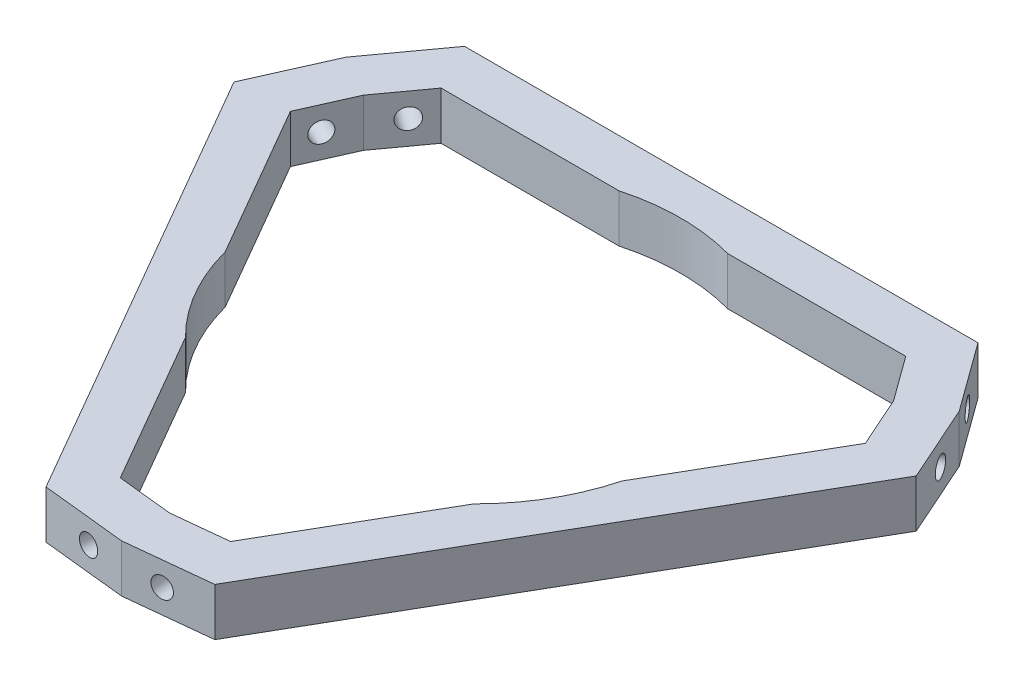
ISO-10303-21;
HEADER;
FILE_DESCRIPTION(('STEP AP214'),'2;1');
FILE_NAME('part.step','',(''),(''),'','','');
FILE_SCHEMA(('AUTOMOTIVE_DESIGN { 1 0 10303 214 1 1 1 1 }'));
ENDSEC;
DATA;
#1=APPLICATION_CONTEXT('core data for automotive mechanical design processes');
#2=APPLICATION_PROTOCOL_DEFINITION('international standard','automotive_design',2000,#1);
#3=PRODUCT_CONTEXT('',#1,'mechanical');
#4=PRODUCT('Part','Part','',(#3));
#5=PRODUCT_RELATED_PRODUCT_CATEGORY('part','',(#4));
#6=PRODUCT_DEFINITION_FORMATION('','',#4);
#7=PRODUCT_DEFINITION_CONTEXT('part definition',#1,'design');
#8=PRODUCT_DEFINITION('design','',#6,#7);
#9=PRODUCT_DEFINITION_SHAPE('','',#8);
#10=(LENGTH_UNIT() NAMED_UNIT(*) SI_UNIT(.MILLI.,.METRE.));
#11=(NAMED_UNIT(*) PLANE_ANGLE_UNIT() SI_UNIT($,.RADIAN.));
#12=(NAMED_UNIT(*) SI_UNIT($,.STERADIAN.) SOLID_ANGLE_UNIT());
#13=UNCERTAINTY_MEASURE_WITH_UNIT(LENGTH_MEASURE(1.E-05),#10,'distance_accuracy_value','');
#14=(GEOMETRIC_REPRESENTATION_CONTEXT(3) GLOBAL_UNCERTAINTY_ASSIGNED_CONTEXT((#13)) GLOBAL_UNIT_ASSIGNED_CONTEXT((#10,
#11,#12)) REPRESENTATION_CONTEXT('',''));
#15=CARTESIAN_POINT('',(0.,0.,0.));
#16=DIRECTION('',(0.,0.,1.));
#17=DIRECTION('',(1.,0.,0.));
#18=AXIS2_PLACEMENT_3D('',#15,#16,#17);
#19=CARTESIAN_POINT('',(-47.047591068594,3.5,-20.9469371184036));
#20=DIRECTION('',(-0.913545457642602,0.,-0.406736643075799));
#21=DIRECTION('',(-0.406736643075799,0.,0.913545457642602));
#22=AXIS2_PLACEMENT_3D('',#19,#20,#21);
#23=PLANE('',#22);
#24=CARTESIAN_POINT('',(-47.047591068594,0.,-20.9469371184036));
#25=DIRECTION('',(0.913545457642601,0.,0.406736643075799));
#26=DIRECTION('',(0.406736643075799,0.,-0.913545457642601));
#27=AXIS2_PLACEMENT_3D('',#24,#25,#26);
#28=CIRCLE('',#27,1.50000000000001);
#29=CARTESIAN_POINT('',(-46.4374861039803,0.,-22.3172553048676));
#30=VERTEX_POINT('',#29);
#31=EDGE_CURVE('E825',#30,#30,#28,.T.);
#32=ORIENTED_EDGE('',*,*,#31,.T.);
#33=EDGE_LOOP('',(#32));
#34=FACE_BOUND('',#33,.T.);
#35=DIRECTION('',(0.406736643075799,0.,-0.913545457642601));
#36=VECTOR('',#35,1.);
#37=CARTESIAN_POINT('',(-47.047591068594,-3.5,-20.9469371184036));
#38=LINE('',#37,#36);
#39=CARTESIAN_POINT('',(-49.8947475701246,-3.5,-14.5521189149054));
#40=VERTEX_POINT('',#39);
#41=CARTESIAN_POINT('',(-44.8459792616059,-3.5,-25.8918381987605));
#42=VERTEX_POINT('',#41);
#43=EDGE_CURVE('E271',#40,#42,#38,.T.);
#44=ORIENTED_EDGE('',*,*,#43,.F.);
#45=DIRECTION('',(0.,-1.,0.));
#46=VECTOR('',#45,1.);
#47=CARTESIAN_POINT('',(-49.8947475701246,3.5,-14.5521189149054));
#48=LINE('',#47,#46);
#49=CARTESIAN_POINT('',(-49.8947475701246,3.5,-14.5521189149054));
#50=VERTEX_POINT('',#49);
#51=EDGE_CURVE('E11',#50,#40,#48,.T.);
#52=ORIENTED_EDGE('',*,*,#51,.F.);
#53=DIRECTION('',(0.406736643075799,0.,-0.913545457642601));
#54=VECTOR('',#53,1.);
#55=CARTESIAN_POINT('',(-47.047591068594,3.5,-20.9469371184036));
#56=LINE('',#55,#54);
#57=CARTESIAN_POINT('',(-44.8459792616059,3.5,-25.8918381987605));
#58=VERTEX_POINT('',#57);
#59=EDGE_CURVE('E806',#50,#58,#56,.T.);
#60=ORIENTED_EDGE('',*,*,#59,.T.);
#61=DIRECTION('',(0.,-1.,0.));
#62=VECTOR('',#61,1.);
#63=CARTESIAN_POINT('',(-44.8459792616059,3.5,-25.8918381987605));
#64=LINE('',#63,#62);
#65=EDGE_CURVE('E55',#58,#42,#64,.T.);
#66=ORIENTED_EDGE('',*,*,#65,.T.);
#67=EDGE_LOOP('',(#44,#52,#60,#66));
#68=FACE_BOUND('',#67,.T.);
#69=ADVANCED_FACE('F36',(#34,#68),#23,.T.);
#70=CARTESIAN_POINT('',(-31.1198083479933,3.5,17.9670297268435));
#71=DIRECTION('',(0.866025403784439,0.,-0.5));
#72=DIRECTION('',(-0.5,0.,-0.866025403784439));
#73=AXIS2_PLACEMENT_3D('',#70,#71,#72);
#74=PLANE('',#73);
#75=DIRECTION('',(0.5,0.,0.866025403784439));
#76=VECTOR('',#75,1.);
#77=CARTESIAN_POINT('',(-31.1198083479933,-3.5,17.9670297268435));
#78=LINE('',#77,#76);
#79=CARTESIAN_POINT('',(-12.3448691258623,-3.5,50.4861783685922));
#80=VERTEX_POINT('',#79);
#81=EDGE_CURVE('E273',#40,#80,#78,.T.);
#82=ORIENTED_EDGE('',*,*,#81,.T.);
#83=DIRECTION('',(0.,-1.,0.));
#84=VECTOR('',#83,1.);
#85=CARTESIAN_POINT('',(-12.3448691258623,3.5,50.4861783685922));
#86=LINE('',#85,#84);
#87=CARTESIAN_POINT('',(-12.3448691258623,3.5,50.4861783685922));
#88=VERTEX_POINT('',#87);
#89=EDGE_CURVE('E46',#88,#80,#86,.T.);
#90=ORIENTED_EDGE('',*,*,#89,.F.);
#91=DIRECTION('',(0.5,0.,0.866025403784439));
#92=VECTOR('',#91,1.);
#93=CARTESIAN_POINT('',(-31.1198083479933,3.5,17.9670297268435));
#94=LINE('',#93,#92);
#95=EDGE_CURVE('E802',#50,#88,#94,.T.);
#96=ORIENTED_EDGE('',*,*,#95,.F.);
#97=ORIENTED_EDGE('',*,*,#51,.T.);
#98=EDGE_LOOP('',(#82,#90,#96,#97));
#99=FACE_BOUND('',#98,.T.);
#100=ADVANCED_FACE('F431',(#99),#74,.F.);
#101=CARTESIAN_POINT('',(-5.38321585828411,3.5,51.2178776114658));
#102=DIRECTION('',(-0.104528463267653,0.,0.994521895368273));
#103=DIRECTION('',(0.994521895368273,0.,0.104528463267653));
#104=AXIS2_PLACEMENT_3D('',#101,#102,#103);
#105=PLANE('',#104);
#106=CARTESIAN_POINT('',(-5.38321585828391,0.,51.2178776114661));
#107=DIRECTION('',(0.104528463267649,0.,-0.994521895368274));
#108=DIRECTION('',(-0.994521895368274,0.,-0.104528463267649));
#109=AXIS2_PLACEMENT_3D('',#106,#107,#108);
#110=CIRCLE('',#109,1.50000000000001);
#111=CARTESIAN_POINT('',(-6.87499870133632,0.,51.0610849165646));
#112=VERTEX_POINT('',#111);
#113=EDGE_CURVE('E787',#112,#112,#110,.T.);
#114=ORIENTED_EDGE('',*,*,#113,.T.);
#115=EDGE_LOOP('',(#114));
#116=FACE_BOUND('',#115,.T.);
#117=DIRECTION('',(-0.994521895368273,0.,-0.104528463267653));
#118=VECTOR('',#117,1.);
#119=CARTESIAN_POINT('',(-5.38321585828411,-3.5,51.2178776114658));
#120=LINE('',#119,#118);
#121=CARTESIAN_POINT('',(-1.2490009027033E-13,-3.5,51.7836763975208));
#122=VERTEX_POINT('',#121);
#123=EDGE_CURVE('E276',#122,#80,#120,.T.);
#124=ORIENTED_EDGE('',*,*,#123,.F.);
#125=DIRECTION('',(0.,-1.,0.));
#126=VECTOR('',#125,1.);
#127=CARTESIAN_POINT('',(-1.2490009027033E-13,3.5,51.7836763975208));
#128=LINE('',#127,#126);
#129=CARTESIAN_POINT('',(-1.2490009027033E-13,3.5,51.7836763975208));
#130=VERTEX_POINT('',#129);
#131=EDGE_CURVE('E302',#130,#122,#128,.T.);
#132=ORIENTED_EDGE('',*,*,#131,.F.);
#133=DIRECTION('',(-0.994521895368273,0.,-0.104528463267653));
#134=VECTOR('',#133,1.);
#135=CARTESIAN_POINT('',(-5.38321585828411,3.5,51.2178776114658));
#136=LINE('',#135,#134);
#137=EDGE_CURVE('E800',#130,#88,#136,.T.);
#138=ORIENTED_EDGE('',*,*,#137,.T.);
#139=ORIENTED_EDGE('',*,*,#89,.T.);
#140=EDGE_LOOP('',(#124,#132,#138,#139));
#141=FACE_BOUND('',#140,.T.);
#142=ADVANCED_FACE('F437',(#116,#141),#105,.T.);
#143=CARTESIAN_POINT('',(5.3832158582842,3.5,51.2178776114658));
#144=DIRECTION('',(0.104528463267655,0.,0.994521895368273));
#145=DIRECTION('',(0.994521895368273,0.,-0.104528463267655));
#146=AXIS2_PLACEMENT_3D('',#143,#144,#145);
#147=PLANE('',#146);
#148=CARTESIAN_POINT('',(5.38321585828446,0.,51.217877611466));
#149=DIRECTION('',(-0.104528463267659,0.,-0.994521895368273));
#150=DIRECTION('',(-0.994521895368273,0.,0.104528463267659));
#151=AXIS2_PLACEMENT_3D('',#148,#149,#150);
#152=CIRCLE('',#151,1.50000000000001);
#153=CARTESIAN_POINT('',(3.89143301523204,0.,51.3746703063675));
#154=VERTEX_POINT('',#153);
#155=EDGE_CURVE('E836',#154,#154,#152,.T.);
#156=ORIENTED_EDGE('',*,*,#155,.T.);
#157=EDGE_LOOP('',(#156));
#158=FACE_BOUND('',#157,.T.);
#159=DIRECTION('',(-0.994521895368273,0.,0.104528463267655));
#160=VECTOR('',#159,1.);
#161=CARTESIAN_POINT('',(5.3832158582842,-3.5,51.2178776114658));
#162=LINE('',#161,#160);
#163=CARTESIAN_POINT('',(12.3448691258619,-3.5,50.4861783685922));
#164=VERTEX_POINT('',#163);
#165=EDGE_CURVE('E279',#164,#122,#162,.T.);
#166=ORIENTED_EDGE('',*,*,#165,.F.);
#167=DIRECTION('',(0.,-1.,0.));
#168=VECTOR('',#167,1.);
#169=CARTESIAN_POINT('',(12.3448691258619,3.5,50.4861783685922));
#170=LINE('',#169,#168);
#171=CARTESIAN_POINT('',(12.3448691258619,3.5,50.4861783685922));
#172=VERTEX_POINT('',#171);
#173=EDGE_CURVE('E300',#172,#164,#170,.T.);
#174=ORIENTED_EDGE('',*,*,#173,.F.);
#175=DIRECTION('',(-0.994521895368273,0.,0.104528463267655));
#176=VECTOR('',#175,1.);
#177=CARTESIAN_POINT('',(5.3832158582842,3.5,51.2178776114658));
#178=LINE('',#177,#176);
#179=EDGE_CURVE('E799',#172,#130,#178,.T.);
#180=ORIENTED_EDGE('',*,*,#179,.T.);
#181=ORIENTED_EDGE('',*,*,#131,.T.);
#182=EDGE_LOOP('',(#166,#174,#180,#181));
#183=FACE_BOUND('',#182,.T.);
#184=ADVANCED_FACE('F750',(#158,#183),#147,.T.);
#185=CARTESIAN_POINT('',(31.1198083479931,3.5,17.9670297268433));
#186=DIRECTION('',(-0.866025403784439,0.,-0.5));
#187=DIRECTION('',(-0.5,0.,0.866025403784439));
#188=AXIS2_PLACEMENT_3D('',#185,#186,#187);
#189=PLANE('',#188);
#190=DIRECTION('',(0.5,0.,-0.866025403784439));
#191=VECTOR('',#190,1.);
#192=CARTESIAN_POINT('',(31.1198083479931,-3.5,17.9670297268433));
#193=LINE('',#192,#191);
#194=CARTESIAN_POINT('',(49.8947475701242,-3.5,-14.5521189149055));
#195=VERTEX_POINT('',#194);
#196=EDGE_CURVE('E282',#164,#195,#193,.T.);
#197=ORIENTED_EDGE('',*,*,#196,.T.);
#198=DIRECTION('',(0.,-1.,0.));
#199=VECTOR('',#198,1.);
#200=CARTESIAN_POINT('',(49.8947475701242,3.5,-14.5521189149055));
#201=LINE('',#200,#199);
#202=CARTESIAN_POINT('',(49.8947475701242,3.5,-14.5521189149055));
#203=VERTEX_POINT('',#202);
#204=EDGE_CURVE('E298',#203,#195,#201,.T.);
#205=ORIENTED_EDGE('',*,*,#204,.F.);
#206=DIRECTION('',(0.5,0.,-0.866025403784439));
#207=VECTOR('',#206,1.);
#208=CARTESIAN_POINT('',(31.1198083479931,3.5,17.9670297268433));
#209=LINE('',#208,#207);
#210=EDGE_CURVE('E228',#172,#203,#209,.T.);
#211=ORIENTED_EDGE('',*,*,#210,.F.);
#212=ORIENTED_EDGE('',*,*,#173,.T.);
#213=EDGE_LOOP('',(#197,#205,#211,#212));
#214=FACE_BOUND('',#213,.T.);
#215=ADVANCED_FACE('F741',(#214),#189,.F.);
#216=CARTESIAN_POINT('',(47.0475910685936,3.5,-20.9469371184036));
#217=DIRECTION('',(0.913545457642601,0.,-0.4067366430758));
#218=DIRECTION('',(-0.4067366430758,0.,-0.913545457642601));
#219=AXIS2_PLACEMENT_3D('',#216,#217,#218);
#220=PLANE('',#219);
#221=CARTESIAN_POINT('',(47.0475910685937,0.,-20.9469371184042));
#222=DIRECTION('',(-0.913545457642597,0.,0.406736643075809));
#223=DIRECTION('',(0.406736643075809,0.,0.913545457642597));
#224=AXIS2_PLACEMENT_3D('',#221,#222,#223);
#225=CIRCLE('',#224,1.50000000000001);
#226=CARTESIAN_POINT('',(47.6576960332075,0.,-19.5766189319403));
#227=VERTEX_POINT('',#226);
#228=EDGE_CURVE('E852',#227,#227,#225,.T.);
#229=ORIENTED_EDGE('',*,*,#228,.T.);
#230=EDGE_LOOP('',(#229));
#231=FACE_BOUND('',#230,.T.);
#232=DIRECTION('',(0.4067366430758,0.,0.913545457642601));
#233=VECTOR('',#232,1.);
#234=CARTESIAN_POINT('',(47.0475910685936,-3.5,-20.9469371184036));
#235=LINE('',#234,#233);
#236=CARTESIAN_POINT('',(44.8459792616055,-3.5,-25.8918381987606));
#237=VERTEX_POINT('',#236);
#238=EDGE_CURVE('E285',#237,#195,#235,.T.);
#239=ORIENTED_EDGE('',*,*,#238,.F.);
#240=DIRECTION('',(0.,-1.,0.));
#241=VECTOR('',#240,1.);
#242=CARTESIAN_POINT('',(44.8459792616055,3.5,-25.8918381987606));
#243=LINE('',#242,#241);
#244=CARTESIAN_POINT('',(44.8459792616055,3.5,-25.8918381987606));
#245=VERTEX_POINT('',#244);
#246=EDGE_CURVE('E214',#245,#237,#243,.T.);
#247=ORIENTED_EDGE('',*,*,#246,.F.);
#248=DIRECTION('',(0.4067366430758,0.,0.913545457642601));
#249=VECTOR('',#248,1.);
#250=CARTESIAN_POINT('',(47.0475910685936,3.5,-20.9469371184036));
#251=LINE('',#250,#249);
#252=EDGE_CURVE('E226',#245,#203,#251,.T.);
#253=ORIENTED_EDGE('',*,*,#252,.T.);
#254=ORIENTED_EDGE('',*,*,#204,.T.);
#255=EDGE_LOOP('',(#239,#247,#253,#254));
#256=FACE_BOUND('',#255,.T.);
#257=ADVANCED_FACE('F732',(#231,#256),#220,.T.);
#258=CARTESIAN_POINT('',(41.6643752103095,3.5,-30.2709404930622));
#259=DIRECTION('',(0.809016994374947,0.,-0.587785252292474));
#260=DIRECTION('',(-0.587785252292474,0.,-0.809016994374947));
#261=AXIS2_PLACEMENT_3D('',#258,#259,#260);
#262=PLANE('',#261);
#263=CARTESIAN_POINT('',(41.6643752103095,0.,-30.2709404930628));
#264=DIRECTION('',(-0.809016994374941,0.,0.587785252292482));
#265=DIRECTION('',(0.587785252292482,0.,0.809016994374941));
#266=AXIS2_PLACEMENT_3D('',#263,#264,#265);
#267=CIRCLE('',#266,1.50000000000001);
#268=CARTESIAN_POINT('',(42.5460530887482,0.,-29.0574150015004));
#269=VERTEX_POINT('',#268);
#270=EDGE_CURVE('E842',#269,#269,#267,.T.);
#271=ORIENTED_EDGE('',*,*,#270,.T.);
#272=EDGE_LOOP('',(#271));
#273=FACE_BOUND('',#272,.T.);
#274=DIRECTION('',(0.587785252292474,0.,0.809016994374947));
#275=VECTOR('',#274,1.);
#276=CARTESIAN_POINT('',(41.6643752103095,-3.5,-30.2709404930622));
#277=LINE('',#276,#275);
#278=CARTESIAN_POINT('',(37.5498784442621,-3.5,-35.934059453687));
#279=VERTEX_POINT('',#278);
#280=EDGE_CURVE('E211',#279,#237,#277,.T.);
#281=ORIENTED_EDGE('',*,*,#280,.F.);
#282=DIRECTION('',(0.,-1.,0.));
#283=VECTOR('',#282,1.);
#284=CARTESIAN_POINT('',(37.5498784442621,3.5,-35.934059453687));
#285=LINE('',#284,#283);
#286=CARTESIAN_POINT('',(37.5498784442621,3.5,-35.934059453687));
#287=VERTEX_POINT('',#286);
#288=EDGE_CURVE('E205',#287,#279,#285,.T.);
#289=ORIENTED_EDGE('',*,*,#288,.F.);
#290=DIRECTION('',(0.587785252292474,0.,0.809016994374947));
#291=VECTOR('',#290,1.);
#292=CARTESIAN_POINT('',(41.6643752103095,3.5,-30.2709404930622));
#293=LINE('',#292,#291);
#294=EDGE_CURVE('E209',#287,#245,#293,.T.);
#295=ORIENTED_EDGE('',*,*,#294,.T.);
#296=ORIENTED_EDGE('',*,*,#246,.T.);
#297=EDGE_LOOP('',(#281,#289,#295,#296));
#298=FACE_BOUND('',#297,.T.);
#299=ADVANCED_FACE('F207',(#273,#298),#262,.T.);
#300=CARTESIAN_POINT('',(0.,3.5,-35.934059453687));
#301=DIRECTION('',(0.,0.,1.));
#302=DIRECTION('',(1.,0.,0.));
#303=AXIS2_PLACEMENT_3D('',#300,#301,#302);
#304=PLANE('',#303);
#305=DIRECTION('',(-1.,0.,0.));
#306=VECTOR('',#305,1.);
#307=CARTESIAN_POINT('',(0.,-3.5,-35.934059453687));
#308=LINE('',#307,#306);
#309=CARTESIAN_POINT('',(-37.5498784442625,-3.5,-35.934059453687));
#310=VERTEX_POINT('',#309);
#311=EDGE_CURVE('E289',#279,#310,#308,.T.);
#312=ORIENTED_EDGE('',*,*,#311,.T.);
#313=DIRECTION('',(0.,-1.,0.));
#314=VECTOR('',#313,1.);
#315=CARTESIAN_POINT('',(-37.5498784442625,3.5,-35.934059453687));
#316=LINE('',#315,#314);
#317=CARTESIAN_POINT('',(-37.5498784442625,3.5,-35.934059453687));
#318=VERTEX_POINT('',#317);
#319=EDGE_CURVE('E129',#318,#310,#316,.T.);
#320=ORIENTED_EDGE('',*,*,#319,.F.);
#321=DIRECTION('',(-1.,0.,0.));
#322=VECTOR('',#321,1.);
#323=CARTESIAN_POINT('',(0.,3.5,-35.934059453687));
#324=LINE('',#323,#322);
#325=EDGE_CURVE('E216',#287,#318,#324,.T.);
#326=ORIENTED_EDGE('',*,*,#325,.F.);
#327=ORIENTED_EDGE('',*,*,#288,.T.);
#328=EDGE_LOOP('',(#312,#320,#326,#327));
#329=FACE_BOUND('',#328,.T.);
#330=ADVANCED_FACE('F217',(#329),#304,.F.);
#331=CARTESIAN_POINT('',(25.057630521502,3.5,14.4670297268434));
#332=DIRECTION('',(-0.866025403784439,0.,-0.5));
#333=DIRECTION('',(-0.5,0.,0.866025403784439));
#334=AXIS2_PLACEMENT_3D('',#331,#332,#333);
#335=PLANE('',#334);
#336=DIRECTION('',(0.5,0.,-0.866025403784439));
#337=VECTOR('',#336,1.);
#338=CARTESIAN_POINT('',(25.057630521502,-3.5,14.4670297268434));
#339=LINE('',#338,#337);
#340=CARTESIAN_POINT('',(8.06603037260135,-3.5,43.8973444866342));
#341=VERTEX_POINT('',#340);
#342=CARTESIAN_POINT('',(21.0946706576338,-3.5,21.3310775594194));
#343=VERTEX_POINT('',#342);
#344=EDGE_CURVE('E234',#341,#343,#339,.T.);
#345=ORIENTED_EDGE('',*,*,#344,.F.);
#346=DIRECTION('',(0.,-1.,0.));
#347=VECTOR('',#346,1.);
#348=CARTESIAN_POINT('',(8.06603037260135,3.5,43.8973444866342));
#349=LINE('',#348,#347);
#350=CARTESIAN_POINT('',(8.06603037260135,3.5,43.8973444866342));
#351=VERTEX_POINT('',#350);
#352=EDGE_CURVE('E40',#351,#341,#349,.T.);
#353=ORIENTED_EDGE('',*,*,#352,.F.);
#354=DIRECTION('',(0.5,0.,-0.866025403784439));
#355=VECTOR('',#354,1.);
#356=CARTESIAN_POINT('',(25.057630521502,3.5,14.4670297268434));
#357=LINE('',#356,#355);
#358=CARTESIAN_POINT('',(21.0946706576338,3.5,21.3310775594194));
#359=VERTEX_POINT('',#358);
#360=EDGE_CURVE('E294',#351,#359,#357,.T.);
#361=ORIENTED_EDGE('',*,*,#360,.T.);
#362=DIRECTION('',(0.,-1.,0.));
#363=VECTOR('',#362,1.);
#364=CARTESIAN_POINT('',(21.0946706576338,3.5,21.3310775594194));
#365=LINE('',#364,#363);
#366=EDGE_CURVE('E233',#359,#343,#365,.T.);
#367=ORIENTED_EDGE('',*,*,#366,.T.);
#368=EDGE_LOOP('',(#345,#353,#361,#367));
#369=FACE_BOUND('',#368,.T.);
#370=ADVANCED_FACE('F345',(#369),#335,.T.);
#371=CARTESIAN_POINT('',(4.65151661541064,3.5,44.2562243438878));
#372=DIRECTION('',(0.104528463267655,0.,0.994521895368273));
#373=DIRECTION('',(0.994521895368273,0.,-0.104528463267656));
#374=AXIS2_PLACEMENT_3D('',#371,#372,#373);
#375=PLANE('',#374);
#376=CARTESIAN_POINT('',(4.65151661541084,0.,44.2562243438881));
#377=DIRECTION('',(-0.104528463267659,0.,-0.994521895368273));
#378=DIRECTION('',(-0.994521895368273,0.,0.104528463267659));
#379=AXIS2_PLACEMENT_3D('',#376,#377,#378);
#380=CIRCLE('',#379,1.50000000000001);
#381=CARTESIAN_POINT('',(3.15973377235842,0.,44.4130170387896));
#382=VERTEX_POINT('',#381);
#383=EDGE_CURVE('E833',#382,#382,#380,.T.);
#384=ORIENTED_EDGE('',*,*,#383,.F.);
#385=EDGE_LOOP('',(#384));
#386=FACE_BOUND('',#385,.T.);
#387=DIRECTION('',(-0.994521895368273,0.,0.104528463267656));
#388=VECTOR('',#387,1.);
#389=CARTESIAN_POINT('',(4.65151661541064,-3.5,44.2562243438878));
#390=LINE('',#389,#388);
#391=CARTESIAN_POINT('',(-1.04083408558608E-13,-3.5,44.7451184405762));
#392=VERTEX_POINT('',#391);
#393=EDGE_CURVE('E237',#341,#392,#390,.T.);
#394=ORIENTED_EDGE('',*,*,#393,.T.);
#395=DIRECTION('',(0.,-1.,0.));
#396=VECTOR('',#395,1.);
#397=CARTESIAN_POINT('',(-1.04083408558608E-13,3.5,44.7451184405762));
#398=LINE('',#397,#396);
#399=CARTESIAN_POINT('',(-1.04083408558608E-13,3.5,44.7451184405762));
#400=VERTEX_POINT('',#399);
#401=EDGE_CURVE('E331',#400,#392,#398,.T.);
#402=ORIENTED_EDGE('',*,*,#401,.F.);
#403=DIRECTION('',(-0.994521895368273,0.,0.104528463267656));
#404=VECTOR('',#403,1.);
#405=CARTESIAN_POINT('',(4.65151661541064,3.5,44.2562243438878));
#406=LINE('',#405,#404);
#407=EDGE_CURVE('E339',#351,#400,#406,.T.);
#408=ORIENTED_EDGE('',*,*,#407,.F.);
#409=ORIENTED_EDGE('',*,*,#352,.T.);
#410=EDGE_LOOP('',(#394,#402,#408,#409));
#411=FACE_BOUND('',#410,.T.);
#412=ADVANCED_FACE('F38',(#386,#411),#375,.F.);
#413=CARTESIAN_POINT('',(-4.65151661541055,3.5,44.2562243438879));
#414=DIRECTION('',(-0.104528463267653,0.,0.994521895368273));
#415=DIRECTION('',(0.994521895368273,0.,0.104528463267653));
#416=AXIS2_PLACEMENT_3D('',#413,#414,#415);
#417=PLANE('',#416);
#418=CARTESIAN_POINT('',(-4.65151661541036,0.,44.2562243438882));
#419=DIRECTION('',(0.104528463267649,0.,-0.994521895368274));
#420=DIRECTION('',(-0.994521895368274,0.,-0.104528463267649));
#421=AXIS2_PLACEMENT_3D('',#418,#419,#420);
#422=CIRCLE('',#421,1.50000000000001);
#423=CARTESIAN_POINT('',(-6.14329945846278,0.,44.0994316489867));
#424=VERTEX_POINT('',#423);
#425=EDGE_CURVE('E845',#424,#424,#422,.T.);
#426=ORIENTED_EDGE('',*,*,#425,.F.);
#427=EDGE_LOOP('',(#426));
#428=FACE_BOUND('',#427,.T.);
#429=DIRECTION('',(-0.994521895368274,0.,-0.104528463267653));
#430=VECTOR('',#429,1.);
#431=CARTESIAN_POINT('',(-4.65151661541055,-3.5,44.2562243438879));
#432=LINE('',#431,#430);
#433=CARTESIAN_POINT('',(-8.06603037260172,-3.5,43.8973444866342));
#434=VERTEX_POINT('',#433);
#435=EDGE_CURVE('E241',#392,#434,#432,.T.);
#436=ORIENTED_EDGE('',*,*,#435,.T.);
#437=DIRECTION('',(0.,-1.,0.));
#438=VECTOR('',#437,1.);
#439=CARTESIAN_POINT('',(-8.06603037260172,3.5,43.8973444866342));
#440=LINE('',#439,#438);
#441=CARTESIAN_POINT('',(-8.06603037260172,3.5,43.8973444866342));
#442=VERTEX_POINT('',#441);
#443=EDGE_CURVE('E330',#442,#434,#440,.T.);
#444=ORIENTED_EDGE('',*,*,#443,.F.);
#445=DIRECTION('',(-0.994521895368274,0.,-0.104528463267653));
#446=VECTOR('',#445,1.);
#447=CARTESIAN_POINT('',(-4.65151661541055,3.5,44.2562243438879));
#448=LINE('',#447,#446);
#449=EDGE_CURVE('E819',#400,#442,#448,.T.);
#450=ORIENTED_EDGE('',*,*,#449,.F.);
#451=ORIENTED_EDGE('',*,*,#401,.T.);
#452=EDGE_LOOP('',(#436,#444,#450,#451));
#453=FACE_BOUND('',#452,.T.);
#454=ADVANCED_FACE('F419',(#428,#453),#417,.F.);
#455=CARTESIAN_POINT('',(-25.0576305215023,3.5,14.4670297268435));
#456=DIRECTION('',(0.866025403784439,0.,-0.5));
#457=DIRECTION('',(-0.5,0.,-0.866025403784439));
#458=AXIS2_PLACEMENT_3D('',#455,#456,#457);
#459=PLANE('',#458);
#460=DIRECTION('',(0.5,0.,0.866025403784439));
#461=VECTOR('',#460,1.);
#462=CARTESIAN_POINT('',(-25.0576305215023,-3.5,14.4670297268435));
#463=LINE('',#462,#461);
#464=CARTESIAN_POINT('',(-21.0946706576346,-3.5,21.3310775594185));
#465=VERTEX_POINT('',#464);
#466=EDGE_CURVE('E244',#465,#434,#463,.T.);
#467=ORIENTED_EDGE('',*,*,#466,.F.);
#468=DIRECTION('',(0.,-1.,0.));
#469=VECTOR('',#468,1.);
#470=CARTESIAN_POINT('',(-21.0946706576346,3.5,21.3310775594185));
#471=LINE('',#470,#469);
#472=CARTESIAN_POINT('',(-21.0946706576346,3.5,21.3310775594185));
#473=VERTEX_POINT('',#472);
#474=EDGE_CURVE('E328',#473,#465,#471,.T.);
#475=ORIENTED_EDGE('',*,*,#474,.F.);
#476=DIRECTION('',(0.5,0.,0.866025403784439));
#477=VECTOR('',#476,1.);
#478=CARTESIAN_POINT('',(-25.0576305215023,3.5,14.4670297268435));
#479=LINE('',#478,#477);
#480=EDGE_CURVE('E418',#473,#442,#479,.T.);
#481=ORIENTED_EDGE('',*,*,#480,.T.);
#482=ORIENTED_EDGE('',*,*,#443,.T.);
#483=EDGE_LOOP('',(#467,#475,#481,#482));
#484=FACE_BOUND('',#483,.T.);
#485=ADVANCED_FACE('F414',(#484),#459,.T.);
#486=CARTESIAN_POINT('',(0.,3.5,0.));
#487=DIRECTION('',(0.,-1.,0.));
#488=DIRECTION('',(0.,0.,-1.));
#489=AXIS2_PLACEMENT_3D('',#486,#487,#488);
#490=CYLINDRICAL_SURFACE('',#489,30.);
#491=CARTESIAN_POINT('',(0.,-3.5,0.));
#492=DIRECTION('',(0.,1.,0.));
#493=DIRECTION('',(0.,0.,1.));
#494=AXIS2_PLACEMENT_3D('',#491,#492,#493);
#495=CIRCLE('',#494,30.);
#496=CARTESIAN_POINT('',(-29.0205903853699,-3.5,7.60298189426853));
#497=VERTEX_POINT('',#496);
#498=EDGE_CURVE('E247',#497,#465,#495,.T.);
#499=ORIENTED_EDGE('',*,*,#498,.F.);
#500=DIRECTION('',(0.,-1.,0.));
#501=VECTOR('',#500,1.);
#502=CARTESIAN_POINT('',(-29.0205903853699,3.5,7.60298189426853));
#503=LINE('',#502,#501);
#504=CARTESIAN_POINT('',(-29.0205903853699,3.5,7.60298189426853));
#505=VERTEX_POINT('',#504);
#506=EDGE_CURVE('E326',#505,#497,#503,.T.);
#507=ORIENTED_EDGE('',*,*,#506,.F.);
#508=CARTESIAN_POINT('',(0.,3.5,0.));
#509=DIRECTION('',(0.,1.,0.));
#510=DIRECTION('',(0.,0.,1.));
#511=AXIS2_PLACEMENT_3D('',#508,#509,#510);
#512=CIRCLE('',#511,30.);
#513=EDGE_CURVE('E816',#505,#473,#512,.T.);
#514=ORIENTED_EDGE('',*,*,#513,.T.);
#515=ORIENTED_EDGE('',*,*,#474,.T.);
#516=EDGE_LOOP('',(#499,#507,#514,#515));
#517=FACE_BOUND('',#516,.T.);
#518=ADVANCED_FACE('F411',(#517),#490,.F.);
#519=CARTESIAN_POINT('',(-42.049230670403,-3.5,-14.9632850329474));
#520=VERTEX_POINT('',#519);
#521=EDGE_CURVE('E248',#520,#497,#463,.T.);
#522=ORIENTED_EDGE('',*,*,#521,.F.);
#523=DIRECTION('',(0.,-1.,0.));
#524=VECTOR('',#523,1.);
#525=CARTESIAN_POINT('',(-42.049230670403,3.5,-14.9632850329474));
#526=LINE('',#525,#524);
#527=CARTESIAN_POINT('',(-42.049230670403,3.5,-14.9632850329474));
#528=VERTEX_POINT('',#527);
#529=EDGE_CURVE('E324',#528,#520,#526,.T.);
#530=ORIENTED_EDGE('',*,*,#529,.F.);
#531=EDGE_CURVE('E407',#528,#505,#479,.T.);
#532=ORIENTED_EDGE('',*,*,#531,.T.);
#533=ORIENTED_EDGE('',*,*,#506,.T.);
#534=EDGE_LOOP('',(#522,#530,#532,#533));
#535=FACE_BOUND('',#534,.T.);
#536=ADVANCED_FACE('F404',(#535),#459,.T.);
#537=CARTESIAN_POINT('',(-40.6527728650957,3.5,-18.0997806168731));
#538=DIRECTION('',(-0.913545457642601,0.,-0.406736643075799));
#539=DIRECTION('',(-0.406736643075799,0.,0.913545457642601));
#540=AXIS2_PLACEMENT_3D('',#537,#538,#539);
#541=PLANE('',#540);
#542=CARTESIAN_POINT('',(-40.6527728650958,0.,-18.0997806168731));
#543=DIRECTION('',(0.913545457642601,0.,0.406736643075799));
#544=DIRECTION('',(0.406736643075799,0.,-0.913545457642601));
#545=AXIS2_PLACEMENT_3D('',#542,#543,#544);
#546=CIRCLE('',#545,1.50000000000001);
#547=CARTESIAN_POINT('',(-40.0426679004821,0.,-19.470098803337));
#548=VERTEX_POINT('',#547);
#549=EDGE_CURVE('E238',#548,#548,#546,.T.);
#550=ORIENTED_EDGE('',*,*,#549,.F.);
#551=EDGE_LOOP('',(#550));
#552=FACE_BOUND('',#551,.T.);
#553=DIRECTION('',(0.406736643075799,0.,-0.913545457642601));
#554=VECTOR('',#553,1.);
#555=CARTESIAN_POINT('',(-40.6527728650957,-3.5,-18.0997806168731));
#556=LINE('',#555,#554);
#557=CARTESIAN_POINT('',(-38.7504092648828,-3.5,-22.3725592202882));
#558=VERTEX_POINT('',#557);
#559=EDGE_CURVE('E251',#520,#558,#556,.T.);
#560=ORIENTED_EDGE('',*,*,#559,.T.);
#561=DIRECTION('',(0.,-1.,0.));
#562=VECTOR('',#561,1.);
#563=CARTESIAN_POINT('',(-38.7504092648828,3.5,-22.3725592202882));
#564=LINE('',#563,#562);
#565=CARTESIAN_POINT('',(-38.7504092648828,3.5,-22.3725592202882));
#566=VERTEX_POINT('',#565);
#567=EDGE_CURVE('E321',#566,#558,#564,.T.);
#568=ORIENTED_EDGE('',*,*,#567,.F.);
#569=DIRECTION('',(0.406736643075799,0.,-0.913545457642601));
#570=VECTOR('',#569,1.);
#571=CARTESIAN_POINT('',(-40.6527728650957,3.5,-18.0997806168731));
#572=LINE('',#571,#570);
#573=EDGE_CURVE('E399',#528,#566,#572,.T.);
#574=ORIENTED_EDGE('',*,*,#573,.F.);
#575=ORIENTED_EDGE('',*,*,#529,.T.);
#576=EDGE_LOOP('',(#560,#568,#574,#575));
#577=FACE_BOUND('',#576,.T.);
#578=ADVANCED_FACE('F398',(#552,#577),#541,.F.);
#579=CARTESIAN_POINT('',(-36.0012562496852,3.5,-26.156443727015));
#580=DIRECTION('',(-0.809016994374948,0.,-0.587785252292473));
#581=DIRECTION('',(-0.587785252292473,0.,0.809016994374948));
#582=AXIS2_PLACEMENT_3D('',#579,#580,#581);
#583=PLANE('',#582);
#584=CARTESIAN_POINT('',(-36.0012562496851,0.,-26.156443727015));
#585=DIRECTION('',(0.809016994374947,0.,0.587785252292473));
#586=DIRECTION('',(0.587785252292473,0.,-0.809016994374948));
#587=AXIS2_PLACEMENT_3D('',#584,#585,#586);
#588=CIRCLE('',#587,1.50000000000001);
#589=CARTESIAN_POINT('',(-35.1195783712464,0.,-27.3699692185775));
#590=VERTEX_POINT('',#589);
#591=EDGE_CURVE('E827',#590,#590,#588,.T.);
#592=ORIENTED_EDGE('',*,*,#591,.F.);
#593=EDGE_LOOP('',(#592));
#594=FACE_BOUND('',#593,.T.);
#595=DIRECTION('',(0.587785252292473,0.,-0.809016994374948));
#596=VECTOR('',#595,1.);
#597=CARTESIAN_POINT('',(-36.0012562496852,-3.5,-26.156443727015));
#598=LINE('',#597,#596);
#599=CARTESIAN_POINT('',(-33.9832002978015,-3.5,-28.934059453687));
#600=VERTEX_POINT('',#599);
#601=EDGE_CURVE('E253',#558,#600,#598,.T.);
#602=ORIENTED_EDGE('',*,*,#601,.T.);
#603=DIRECTION('',(0.,-1.,0.));
#604=VECTOR('',#603,1.);
#605=CARTESIAN_POINT('',(-33.9832002978015,3.5,-28.934059453687));
#606=LINE('',#605,#604);
#607=CARTESIAN_POINT('',(-33.9832002978015,3.5,-28.934059453687));
#608=VERTEX_POINT('',#607);
#609=EDGE_CURVE('E319',#608,#600,#606,.T.);
#610=ORIENTED_EDGE('',*,*,#609,.F.);
#611=DIRECTION('',(0.587785252292473,0.,-0.809016994374948));
#612=VECTOR('',#611,1.);
#613=CARTESIAN_POINT('',(-36.0012562496852,3.5,-26.156443727015));
#614=LINE('',#613,#612);
#615=EDGE_CURVE('E395',#566,#608,#614,.T.);
#616=ORIENTED_EDGE('',*,*,#615,.F.);
#617=ORIENTED_EDGE('',*,*,#567,.T.);
#618=EDGE_LOOP('',(#602,#610,#616,#617));
#619=FACE_BOUND('',#618,.T.);
#620=ADVANCED_FACE('F393',(#594,#619),#583,.F.);
#621=CARTESIAN_POINT('',(0.,3.5,-28.934059453687));
#622=DIRECTION('',(0.,0.,1.));
#623=DIRECTION('',(1.,0.,0.));
#624=AXIS2_PLACEMENT_3D('',#621,#622,#623);
#625=PLANE('',#624);
#626=DIRECTION('',(-1.,0.,0.));
#627=VECTOR('',#626,1.);
#628=CARTESIAN_POINT('',(0.,-3.5,-28.934059453687));
#629=LINE('',#628,#627);
#630=CARTESIAN_POINT('',(-7.92591972773541,-3.5,-28.934059453687));
#631=VERTEX_POINT('',#630);
#632=EDGE_CURVE('E256',#631,#600,#629,.T.);
#633=ORIENTED_EDGE('',*,*,#632,.F.);
#634=DIRECTION('',(0.,-1.,0.));
#635=VECTOR('',#634,1.);
#636=CARTESIAN_POINT('',(-7.92591972773541,3.5,-28.934059453687));
#637=LINE('',#636,#635);
#638=CARTESIAN_POINT('',(-7.92591972773541,3.5,-28.934059453687));
#639=VERTEX_POINT('',#638);
#640=EDGE_CURVE('E317',#639,#631,#637,.T.);
#641=ORIENTED_EDGE('',*,*,#640,.F.);
#642=DIRECTION('',(-1.,0.,0.));
#643=VECTOR('',#642,1.);
#644=CARTESIAN_POINT('',(0.,3.5,-28.934059453687));
#645=LINE('',#644,#643);
#646=EDGE_CURVE('E390',#639,#608,#645,.T.);
#647=ORIENTED_EDGE('',*,*,#646,.T.);
#648=ORIENTED_EDGE('',*,*,#609,.T.);
#649=EDGE_LOOP('',(#633,#641,#647,#648));
#650=FACE_BOUND('',#649,.T.);
#651=ADVANCED_FACE('F386',(#650),#625,.T.);
#652=CARTESIAN_POINT('',(0.,3.5,0.));
#653=DIRECTION('',(0.,-1.,0.));
#654=DIRECTION('',(0.,0.,-1.));
#655=AXIS2_PLACEMENT_3D('',#652,#653,#654);
#656=CYLINDRICAL_SURFACE('',#655,30.);
#657=CARTESIAN_POINT('',(0.,-3.5,0.));
#658=DIRECTION('',(0.,1.,0.));
#659=DIRECTION('',(0.,0.,1.));
#660=AXIS2_PLACEMENT_3D('',#657,#658,#659);
#661=CIRCLE('',#660,30.);
#662=CARTESIAN_POINT('',(7.92591972773541,-3.5,-28.934059453687));
#663=VERTEX_POINT('',#662);
#664=EDGE_CURVE('E259',#663,#631,#661,.T.);
#665=ORIENTED_EDGE('',*,*,#664,.F.);
#666=DIRECTION('',(0.,-1.,0.));
#667=VECTOR('',#666,1.);
#668=CARTESIAN_POINT('',(7.92591972773541,3.5,-28.934059453687));
#669=LINE('',#668,#667);
#670=CARTESIAN_POINT('',(7.92591972773541,3.5,-28.934059453687));
#671=VERTEX_POINT('',#670);
#672=EDGE_CURVE('E315',#671,#663,#669,.T.);
#673=ORIENTED_EDGE('',*,*,#672,.F.);
#674=CARTESIAN_POINT('',(0.,3.5,0.));
#675=DIRECTION('',(0.,1.,0.));
#676=DIRECTION('',(0.,0.,1.));
#677=AXIS2_PLACEMENT_3D('',#674,#675,#676);
#678=CIRCLE('',#677,30.);
#679=EDGE_CURVE('E811',#671,#639,#678,.T.);
#680=ORIENTED_EDGE('',*,*,#679,.T.);
#681=ORIENTED_EDGE('',*,*,#640,.T.);
#682=EDGE_LOOP('',(#665,#673,#680,#681));
#683=FACE_BOUND('',#682,.T.);
#684=ADVANCED_FACE('F381',(#683),#656,.F.);
#685=CARTESIAN_POINT('',(33.9832002978011,-3.5,-28.934059453687));
#686=VERTEX_POINT('',#685);
#687=EDGE_CURVE('E260',#686,#663,#629,.T.);
#688=ORIENTED_EDGE('',*,*,#687,.F.);
#689=DIRECTION('',(0.,-1.,0.));
#690=VECTOR('',#689,1.);
#691=CARTESIAN_POINT('',(33.9832002978011,3.5,-28.934059453687));
#692=LINE('',#691,#690);
#693=CARTESIAN_POINT('',(33.9832002978011,3.5,-28.934059453687));
#694=VERTEX_POINT('',#693);
#695=EDGE_CURVE('E313',#694,#686,#692,.T.);
#696=ORIENTED_EDGE('',*,*,#695,.F.);
#697=EDGE_CURVE('E377',#694,#671,#645,.T.);
#698=ORIENTED_EDGE('',*,*,#697,.T.);
#699=ORIENTED_EDGE('',*,*,#672,.T.);
#700=EDGE_LOOP('',(#688,#696,#698,#699));
#701=FACE_BOUND('',#700,.T.);
#702=ADVANCED_FACE('F374',(#701),#625,.T.);
#703=CARTESIAN_POINT('',(36.0012562496849,3.5,-26.1564437270149));
#704=DIRECTION('',(0.809016994374947,0.,-0.587785252292474));
#705=DIRECTION('',(-0.587785252292474,0.,-0.809016994374947));
#706=AXIS2_PLACEMENT_3D('',#703,#704,#705);
#707=PLANE('',#706);
#708=CARTESIAN_POINT('',(36.0012562496849,0.,-26.1564437270154));
#709=DIRECTION('',(-0.809016994374941,0.,0.587785252292482));
#710=DIRECTION('',(0.587785252292482,0.,0.809016994374941));
#711=AXIS2_PLACEMENT_3D('',#708,#709,#710);
#712=CIRCLE('',#711,1.50000000000001);
#713=CARTESIAN_POINT('',(36.8829341281236,0.,-24.942918235453));
#714=VERTEX_POINT('',#713);
#715=EDGE_CURVE('E839',#714,#714,#712,.T.);
#716=ORIENTED_EDGE('',*,*,#715,.F.);
#717=EDGE_LOOP('',(#716));
#718=FACE_BOUND('',#717,.T.);
#719=DIRECTION('',(0.587785252292474,0.,0.809016994374947));
#720=VECTOR('',#719,1.);
#721=CARTESIAN_POINT('',(36.0012562496849,-3.5,-26.1564437270149));
#722=LINE('',#721,#720);
#723=CARTESIAN_POINT('',(38.7504092648824,-3.5,-22.3725592202883));
#724=VERTEX_POINT('',#723);
#725=EDGE_CURVE('E263',#686,#724,#722,.T.);
#726=ORIENTED_EDGE('',*,*,#725,.T.);
#727=DIRECTION('',(0.,-1.,0.));
#728=VECTOR('',#727,1.);
#729=CARTESIAN_POINT('',(38.7504092648824,3.5,-22.3725592202883));
#730=LINE('',#729,#728);
#731=CARTESIAN_POINT('',(38.7504092648824,3.5,-22.3725592202883));
#732=VERTEX_POINT('',#731);
#733=EDGE_CURVE('E310',#732,#724,#730,.T.);
#734=ORIENTED_EDGE('',*,*,#733,.F.);
#735=DIRECTION('',(0.587785252292474,0.,0.809016994374947));
#736=VECTOR('',#735,1.);
#737=CARTESIAN_POINT('',(36.0012562496849,3.5,-26.1564437270149));
#738=LINE('',#737,#736);
#739=EDGE_CURVE('E369',#694,#732,#738,.T.);
#740=ORIENTED_EDGE('',*,*,#739,.F.);
#741=ORIENTED_EDGE('',*,*,#695,.T.);
#742=EDGE_LOOP('',(#726,#734,#740,#741));
#743=FACE_BOUND('',#742,.T.);
#744=ADVANCED_FACE('F368',(#718,#743),#707,.F.);
#745=CARTESIAN_POINT('',(40.6527728650954,3.5,-18.099780616873));
#746=DIRECTION('',(0.913545457642601,0.,-0.4067366430758));
#747=DIRECTION('',(-0.4067366430758,0.,-0.913545457642601));
#748=AXIS2_PLACEMENT_3D('',#745,#746,#747);
#749=PLANE('',#748);
#750=CARTESIAN_POINT('',(40.6527728650955,0.,-18.0997806168735));
#751=DIRECTION('',(-0.913545457642597,0.,0.406736643075809));
#752=DIRECTION('',(0.406736643075809,0.,0.913545457642597));
#753=AXIS2_PLACEMENT_3D('',#750,#751,#752);
#754=CIRCLE('',#753,1.50000000000001);
#755=CARTESIAN_POINT('',(41.2628778297093,0.,-16.7294624304096));
#756=VERTEX_POINT('',#755);
#757=EDGE_CURVE('E849',#756,#756,#754,.T.);
#758=ORIENTED_EDGE('',*,*,#757,.F.);
#759=EDGE_LOOP('',(#758));
#760=FACE_BOUND('',#759,.T.);
#761=DIRECTION('',(0.4067366430758,0.,0.913545457642601));
#762=VECTOR('',#761,1.);
#763=CARTESIAN_POINT('',(40.6527728650954,-3.5,-18.099780616873));
#764=LINE('',#763,#762);
#765=CARTESIAN_POINT('',(42.0492306704026,-3.5,-14.9632850329474));
#766=VERTEX_POINT('',#765);
#767=EDGE_CURVE('E265',#724,#766,#764,.T.);
#768=ORIENTED_EDGE('',*,*,#767,.T.);
#769=DIRECTION('',(0.,-1.,0.));
#770=VECTOR('',#769,1.);
#771=CARTESIAN_POINT('',(42.0492306704026,3.5,-14.9632850329474));
#772=LINE('',#771,#770);
#773=CARTESIAN_POINT('',(42.0492306704026,3.5,-14.9632850329474));
#774=VERTEX_POINT('',#773);
#775=EDGE_CURVE('E308',#774,#766,#772,.T.);
#776=ORIENTED_EDGE('',*,*,#775,.F.);
#777=DIRECTION('',(0.4067366430758,0.,0.913545457642601));
#778=VECTOR('',#777,1.);
#779=CARTESIAN_POINT('',(40.6527728650954,3.5,-18.099780616873));
#780=LINE('',#779,#778);
#781=EDGE_CURVE('E365',#732,#774,#780,.T.);
#782=ORIENTED_EDGE('',*,*,#781,.F.);
#783=ORIENTED_EDGE('',*,*,#733,.T.);
#784=EDGE_LOOP('',(#768,#776,#782,#783));
#785=FACE_BOUND('',#784,.T.);
#786=ADVANCED_FACE('F363',(#760,#785),#749,.F.);
#787=CARTESIAN_POINT('',(29.0205903853702,-3.5,7.60298189426735));
#788=VERTEX_POINT('',#787);
#789=EDGE_CURVE('E239',#788,#766,#339,.T.);
#790=ORIENTED_EDGE('',*,*,#789,.F.);
#791=DIRECTION('',(0.,-1.,0.));
#792=VECTOR('',#791,1.);
#793=CARTESIAN_POINT('',(29.0205903853702,3.5,7.60298189426735));
#794=LINE('',#793,#792);
#795=CARTESIAN_POINT('',(29.0205903853702,3.5,7.60298189426735));
#796=VERTEX_POINT('',#795);
#797=EDGE_CURVE('E306',#796,#788,#794,.T.);
#798=ORIENTED_EDGE('',*,*,#797,.F.);
#799=EDGE_CURVE('E360',#796,#774,#357,.T.);
#800=ORIENTED_EDGE('',*,*,#799,.T.);
#801=ORIENTED_EDGE('',*,*,#775,.T.);
#802=EDGE_LOOP('',(#790,#798,#800,#801));
#803=FACE_BOUND('',#802,.T.);
#804=ADVANCED_FACE('F356',(#803),#335,.T.);
#805=CARTESIAN_POINT('',(0.,3.5,0.));
#806=DIRECTION('',(0.,-1.,0.));
#807=DIRECTION('',(0.,0.,-1.));
#808=AXIS2_PLACEMENT_3D('',#805,#806,#807);
#809=CYLINDRICAL_SURFACE('',#808,30.);
#810=CARTESIAN_POINT('',(0.,-3.5,0.));
#811=DIRECTION('',(0.,1.,0.));
#812=DIRECTION('',(0.,0.,1.));
#813=AXIS2_PLACEMENT_3D('',#810,#811,#812);
#814=CIRCLE('',#813,30.);
#815=EDGE_CURVE('E268',#343,#788,#814,.T.);
#816=ORIENTED_EDGE('',*,*,#815,.F.);
#817=ORIENTED_EDGE('',*,*,#366,.F.);
#818=CARTESIAN_POINT('',(0.,3.5,0.));
#819=DIRECTION('',(0.,1.,0.));
#820=DIRECTION('',(0.,0.,1.));
#821=AXIS2_PLACEMENT_3D('',#818,#819,#820);
#822=CIRCLE('',#821,30.);
#823=EDGE_CURVE('E350',#359,#796,#822,.T.);
#824=ORIENTED_EDGE('',*,*,#823,.T.);
#825=ORIENTED_EDGE('',*,*,#797,.T.);
#826=EDGE_LOOP('',(#816,#817,#824,#825));
#827=FACE_BOUND('',#826,.T.);
#828=ADVANCED_FACE('F349',(#827),#809,.F.);
#829=CARTESIAN_POINT('',(-41.6643752103098,3.5,-30.2709404930623));
#830=DIRECTION('',(-0.809016994374948,0.,-0.587785252292472));
#831=DIRECTION('',(-0.587785252292472,0.,0.809016994374948));
#832=AXIS2_PLACEMENT_3D('',#829,#830,#831);
#833=PLANE('',#832);
#834=CARTESIAN_POINT('',(-41.6643752103098,0.,-30.2709404930624));
#835=DIRECTION('',(0.809016994374947,0.,0.587785252292473));
#836=DIRECTION('',(0.587785252292473,0.,-0.809016994374948));
#837=AXIS2_PLACEMENT_3D('',#834,#835,#836);
#838=CIRCLE('',#837,1.50000000000001);
#839=CARTESIAN_POINT('',(-40.7826973318711,0.,-31.4844659846248));
#840=VERTEX_POINT('',#839);
#841=EDGE_CURVE('E830',#840,#840,#838,.T.);
#842=ORIENTED_EDGE('',*,*,#841,.T.);
#843=EDGE_LOOP('',(#842));
#844=FACE_BOUND('',#843,.T.);
#845=DIRECTION('',(0.587785252292472,0.,-0.809016994374948));
#846=VECTOR('',#845,1.);
#847=CARTESIAN_POINT('',(-41.6643752103098,-3.5,-30.2709404930623));
#848=LINE('',#847,#846);
#849=EDGE_CURVE('E291',#42,#310,#848,.T.);
#850=ORIENTED_EDGE('',*,*,#849,.F.);
#851=ORIENTED_EDGE('',*,*,#65,.F.);
#852=DIRECTION('',(0.587785252292472,0.,-0.809016994374948));
#853=VECTOR('',#852,1.);
#854=CARTESIAN_POINT('',(-41.6643752103098,3.5,-30.2709404930623));
#855=LINE('',#854,#853);
#856=EDGE_CURVE('E220',#58,#318,#855,.T.);
#857=ORIENTED_EDGE('',*,*,#856,.T.);
#858=ORIENTED_EDGE('',*,*,#319,.T.);
#859=EDGE_LOOP('',(#850,#851,#857,#858));
#860=FACE_BOUND('',#859,.T.);
#861=ADVANCED_FACE('F445',(#844,#860),#833,.T.);
#862=CARTESIAN_POINT('',(0.,3.5,0.));
#863=DIRECTION('',(0.,1.,0.));
#864=DIRECTION('',(0.,0.,1.));
#865=AXIS2_PLACEMENT_3D('',#862,#863,#864);
#866=PLANE('',#865);
#867=ORIENTED_EDGE('',*,*,#360,.F.);
#868=ORIENTED_EDGE('',*,*,#407,.T.);
#869=ORIENTED_EDGE('',*,*,#449,.T.);
#870=ORIENTED_EDGE('',*,*,#480,.F.);
#871=ORIENTED_EDGE('',*,*,#513,.F.);
#872=ORIENTED_EDGE('',*,*,#531,.F.);
#873=ORIENTED_EDGE('',*,*,#573,.T.);
#874=ORIENTED_EDGE('',*,*,#615,.T.);
#875=ORIENTED_EDGE('',*,*,#646,.F.);
#876=ORIENTED_EDGE('',*,*,#679,.F.);
#877=ORIENTED_EDGE('',*,*,#697,.F.);
#878=ORIENTED_EDGE('',*,*,#739,.T.);
#879=ORIENTED_EDGE('',*,*,#781,.T.);
#880=ORIENTED_EDGE('',*,*,#799,.F.);
#881=ORIENTED_EDGE('',*,*,#823,.F.);
#882=EDGE_LOOP('',(#867,#868,#869,#870,#871,#872,#873,#874,#875,#876,#877,#878,#879,#880,#881));
#883=FACE_BOUND('',#882,.T.);
#884=ORIENTED_EDGE('',*,*,#59,.F.);
#885=ORIENTED_EDGE('',*,*,#95,.T.);
#886=ORIENTED_EDGE('',*,*,#137,.F.);
#887=ORIENTED_EDGE('',*,*,#179,.F.);
#888=ORIENTED_EDGE('',*,*,#210,.T.);
#889=ORIENTED_EDGE('',*,*,#252,.F.);
#890=ORIENTED_EDGE('',*,*,#294,.F.);
#891=ORIENTED_EDGE('',*,*,#325,.T.);
#892=ORIENTED_EDGE('',*,*,#856,.F.);
#893=EDGE_LOOP('',(#884,#885,#886,#887,#888,#889,#890,#891,#892));
#894=FACE_BOUND('',#893,.T.);
#895=ADVANCED_FACE('F224',(#883,#894),#866,.T.);
#896=CARTESIAN_POINT('',(0.,-3.5,0.));
#897=DIRECTION('',(0.,1.,0.));
#898=DIRECTION('',(0.,0.,1.));
#899=AXIS2_PLACEMENT_3D('',#896,#897,#898);
#900=PLANE('',#899);
#901=ORIENTED_EDGE('',*,*,#344,.T.);
#902=ORIENTED_EDGE('',*,*,#815,.T.);
#903=ORIENTED_EDGE('',*,*,#789,.T.);
#904=ORIENTED_EDGE('',*,*,#767,.F.);
#905=ORIENTED_EDGE('',*,*,#725,.F.);
#906=ORIENTED_EDGE('',*,*,#687,.T.);
#907=ORIENTED_EDGE('',*,*,#664,.T.);
#908=ORIENTED_EDGE('',*,*,#632,.T.);
#909=ORIENTED_EDGE('',*,*,#601,.F.);
#910=ORIENTED_EDGE('',*,*,#559,.F.);
#911=ORIENTED_EDGE('',*,*,#521,.T.);
#912=ORIENTED_EDGE('',*,*,#498,.T.);
#913=ORIENTED_EDGE('',*,*,#466,.T.);
#914=ORIENTED_EDGE('',*,*,#435,.F.);
#915=ORIENTED_EDGE('',*,*,#393,.F.);
#916=EDGE_LOOP('',(#901,#902,#903,#904,#905,#906,#907,#908,#909,#910,#911,#912,#913,#914,#915));
#917=FACE_BOUND('',#916,.T.);
#918=ORIENTED_EDGE('',*,*,#43,.T.);
#919=ORIENTED_EDGE('',*,*,#849,.T.);
#920=ORIENTED_EDGE('',*,*,#311,.F.);
#921=ORIENTED_EDGE('',*,*,#280,.T.);
#922=ORIENTED_EDGE('',*,*,#238,.T.);
#923=ORIENTED_EDGE('',*,*,#196,.F.);
#924=ORIENTED_EDGE('',*,*,#165,.T.);
#925=ORIENTED_EDGE('',*,*,#123,.T.);
#926=ORIENTED_EDGE('',*,*,#81,.F.);
#927=EDGE_LOOP('',(#918,#919,#920,#921,#922,#923,#924,#925,#926));
#928=FACE_BOUND('',#927,.T.);
#929=ADVANCED_FACE('F342',(#917,#928),#900,.F.);
#930=CARTESIAN_POINT('',(0.,0.,0.));
#931=DIRECTION('',(0.913545457642601,0.,0.406736643075799));
#932=DIRECTION('',(0.406736643075799,0.,-0.913545457642601));
#933=AXIS2_PLACEMENT_3D('',#930,#931,#932);
#934=CYLINDRICAL_SURFACE('',#933,1.50000000000001);
#935=ORIENTED_EDGE('',*,*,#549,.T.);
#936=EDGE_LOOP('',(#935));
#937=FACE_BOUND('',#936,.T.);
#938=ORIENTED_EDGE('',*,*,#31,.F.);
#939=EDGE_LOOP('',(#938));
#940=FACE_BOUND('',#939,.T.);
#941=ADVANCED_FACE('F533',(#937,#940),#934,.F.);
#942=CARTESIAN_POINT('',(0.,0.,0.));
#943=DIRECTION('',(0.809016994374947,0.,0.587785252292473));
#944=DIRECTION('',(0.587785252292473,0.,-0.809016994374948));
#945=AXIS2_PLACEMENT_3D('',#942,#943,#944);
#946=CYLINDRICAL_SURFACE('',#945,1.50000000000001);
#947=ORIENTED_EDGE('',*,*,#591,.T.);
#948=EDGE_LOOP('',(#947));
#949=FACE_BOUND('',#948,.T.);
#950=ORIENTED_EDGE('',*,*,#841,.F.);
#951=EDGE_LOOP('',(#950));
#952=FACE_BOUND('',#951,.T.);
#953=ADVANCED_FACE('F539',(#949,#952),#946,.F.);
#954=CARTESIAN_POINT('',(0.,0.,0.));
#955=DIRECTION('',(-0.104528463267659,0.,-0.994521895368273));
#956=DIRECTION('',(-0.994521895368273,0.,0.104528463267659));
#957=AXIS2_PLACEMENT_3D('',#954,#955,#956);
#958=CYLINDRICAL_SURFACE('',#957,1.50000000000001);
#959=ORIENTED_EDGE('',*,*,#383,.T.);
#960=EDGE_LOOP('',(#959));
#961=FACE_BOUND('',#960,.T.);
#962=ORIENTED_EDGE('',*,*,#155,.F.);
#963=EDGE_LOOP('',(#962));
#964=FACE_BOUND('',#963,.T.);
#965=ADVANCED_FACE('F546',(#961,#964),#958,.F.);
#966=CARTESIAN_POINT('',(0.,0.,0.));
#967=DIRECTION('',(-0.809016994374941,0.,0.587785252292482));
#968=DIRECTION('',(0.587785252292482,0.,0.809016994374941));
#969=AXIS2_PLACEMENT_3D('',#966,#967,#968);
#970=CYLINDRICAL_SURFACE('',#969,1.50000000000001);
#971=ORIENTED_EDGE('',*,*,#715,.T.);
#972=EDGE_LOOP('',(#971));
#973=FACE_BOUND('',#972,.T.);
#974=ORIENTED_EDGE('',*,*,#270,.F.);
#975=EDGE_LOOP('',(#974));
#976=FACE_BOUND('',#975,.T.);
#977=ADVANCED_FACE('F554',(#973,#976),#970,.F.);
#978=CARTESIAN_POINT('',(0.,0.,0.));
#979=DIRECTION('',(0.104528463267649,0.,-0.994521895368274));
#980=DIRECTION('',(-0.994521895368274,0.,-0.104528463267649));
#981=AXIS2_PLACEMENT_3D('',#978,#979,#980);
#982=CYLINDRICAL_SURFACE('',#981,1.50000000000001);
#983=ORIENTED_EDGE('',*,*,#425,.T.);
#984=EDGE_LOOP('',(#983));
#985=FACE_BOUND('',#984,.T.);
#986=ORIENTED_EDGE('',*,*,#113,.F.);
#987=EDGE_LOOP('',(#986));
#988=FACE_BOUND('',#987,.T.);
#989=ADVANCED_FACE('F562',(#985,#988),#982,.F.);
#990=CARTESIAN_POINT('',(0.,0.,0.));
#991=DIRECTION('',(-0.913545457642597,0.,0.406736643075809));
#992=DIRECTION('',(0.406736643075809,0.,0.913545457642597));
#993=AXIS2_PLACEMENT_3D('',#990,#991,#992);
#994=CYLINDRICAL_SURFACE('',#993,1.50000000000001);
#995=ORIENTED_EDGE('',*,*,#757,.T.);
#996=EDGE_LOOP('',(#995));
#997=FACE_BOUND('',#996,.T.);
#998=ORIENTED_EDGE('',*,*,#228,.F.);
#999=EDGE_LOOP('',(#998));
#1000=FACE_BOUND('',#999,.T.);
#1001=ADVANCED_FACE('F570',(#997,#1000),#994,.F.);
#1002=CLOSED_SHELL('',(#69,#100,#142,#184,#215,#257,#299,#330,#370,#412,#454,#485,#518,#536,
#578,#620,#651,#684,#702,#744,#786,#804,#828,#861,#895,#929,#941,#953,#965,#977,#989,#1001));
#1003=MANIFOLD_SOLID_BREP('B2',#1002);
#1004=ADVANCED_BREP_SHAPE_REPRESENTATION('',(#18,#1003),#14);
#1005=SHAPE_DEFINITION_REPRESENTATION(#9,#1004);
ENDSEC;
END-ISO-10303-21;
